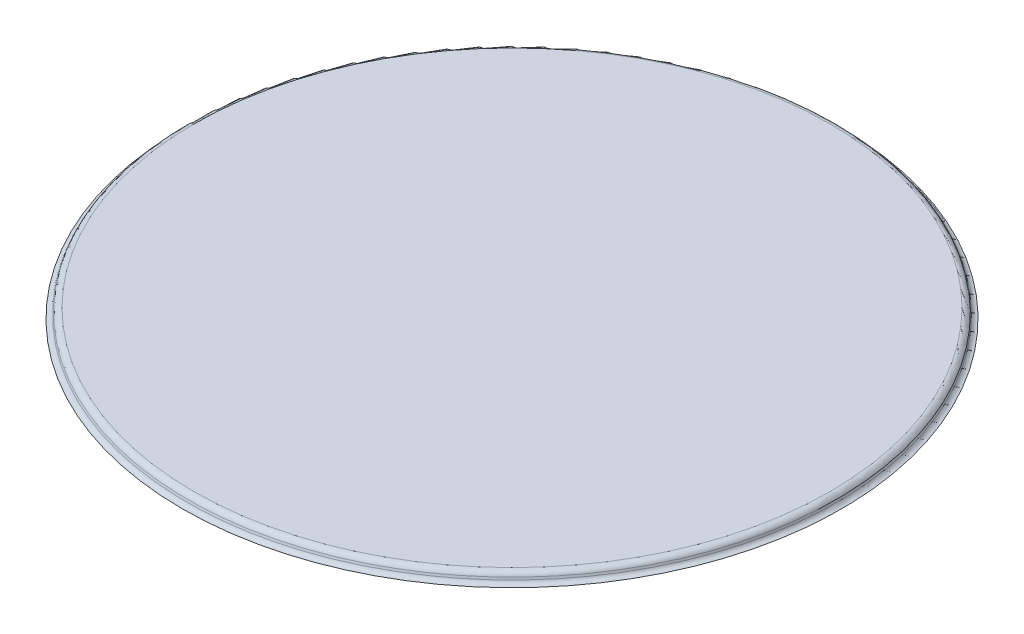
ISO-10303-21;
HEADER;
FILE_DESCRIPTION(('STEP AP214'),'2;1');
FILE_NAME('part.step','',(''),(''),'','','');
FILE_SCHEMA(('AUTOMOTIVE_DESIGN { 1 0 10303 214 1 1 1 1 }'));
ENDSEC;
DATA;
#1=APPLICATION_CONTEXT('core data for automotive mechanical design processes');
#2=APPLICATION_PROTOCOL_DEFINITION('international standard','automotive_design',2000,#1);
#3=PRODUCT_CONTEXT('',#1,'mechanical');
#4=PRODUCT('Part','Part','',(#3));
#5=PRODUCT_RELATED_PRODUCT_CATEGORY('part','',(#4));
#6=PRODUCT_DEFINITION_FORMATION('','',#4);
#7=PRODUCT_DEFINITION_CONTEXT('part definition',#1,'design');
#8=PRODUCT_DEFINITION('design','',#6,#7);
#9=PRODUCT_DEFINITION_SHAPE('','',#8);
#10=(LENGTH_UNIT() NAMED_UNIT(*) SI_UNIT(.MILLI.,.METRE.));
#11=(NAMED_UNIT(*) PLANE_ANGLE_UNIT() SI_UNIT($,.RADIAN.));
#12=(NAMED_UNIT(*) SI_UNIT($,.STERADIAN.) SOLID_ANGLE_UNIT());
#13=UNCERTAINTY_MEASURE_WITH_UNIT(LENGTH_MEASURE(1.E-05),#10,'distance_accuracy_value','');
#14=(GEOMETRIC_REPRESENTATION_CONTEXT(3) GLOBAL_UNCERTAINTY_ASSIGNED_CONTEXT((#13)) GLOBAL_UNIT_ASSIGNED_CONTEXT((#10,
#11,#12)) REPRESENTATION_CONTEXT('',''));
#15=CARTESIAN_POINT('',(0.,0.,0.));
#16=DIRECTION('',(0.,0.,1.));
#17=DIRECTION('',(1.,0.,0.));
#18=AXIS2_PLACEMENT_3D('',#15,#16,#17);
#19=CARTESIAN_POINT('',(0.,10.8,0.));
#20=DIRECTION('',(0.,-1.,0.));
#21=DIRECTION('',(0.,0.,-1.));
#22=AXIS2_PLACEMENT_3D('',#19,#20,#21);
#23=TOROIDAL_SURFACE('',#22,52.5,0.800000000000003);
#24=CARTESIAN_POINT('',(0.,10.,0.));
#25=DIRECTION('',(0.,-1.,0.));
#26=DIRECTION('',(0.,0.,-1.));
#27=AXIS2_PLACEMENT_3D('',#24,#25,#26);
#28=CIRCLE('',#27,52.5);
#29=CARTESIAN_POINT('',(0.,10.,-52.5));
#30=VERTEX_POINT('',#29);
#31=EDGE_CURVE('E50',#30,#30,#28,.F.);
#32=ORIENTED_EDGE('',*,*,#31,.T.);
#33=EDGE_LOOP('',(#32));
#34=FACE_BOUND('',#33,.T.);
#35=CARTESIAN_POINT('',(0.,10.5263838853395,0.));
#36=DIRECTION('',(0.,-1.,0.));
#37=DIRECTION('',(0.,0.,-1.));
#38=AXIS2_PLACEMENT_3D('',#35,#36,#37);
#39=CIRCLE('',#38,51.7482459033713);
#40=CARTESIAN_POINT('',(0.,10.5263838853395,-51.7482459033713));
#41=VERTEX_POINT('',#40);
#42=EDGE_CURVE('E11',#41,#41,#39,.T.);
#43=ORIENTED_EDGE('',*,*,#42,.T.);
#44=EDGE_LOOP('',(#43));
#45=FACE_BOUND('',#44,.T.);
#46=ADVANCED_FACE('F36',(#34,#45),#23,.F.);
#47=CARTESIAN_POINT('',(0.,10.8420201433257,0.));
#48=DIRECTION('',(0.,-1.,0.));
#49=DIRECTION('',(0.,0.,-1.));
#50=AXIS2_PLACEMENT_3D('',#47,#48,#49);
#51=CONICAL_SURFACE('',#50,51.6333637006091,0.349065850398861);
#52=ORIENTED_EDGE('',*,*,#42,.F.);
#53=EDGE_LOOP('',(#52));
#54=FACE_BOUND('',#53,.T.);
#55=CARTESIAN_POINT('',(0.,10.8420201433257,0.));
#56=DIRECTION('',(0.,-1.,0.));
#57=DIRECTION('',(0.,0.,-1.));
#58=AXIS2_PLACEMENT_3D('',#55,#56,#57);
#59=CIRCLE('',#58,51.6333637006091);
#60=CARTESIAN_POINT('',(0.,10.8420201433257,-51.6333637006091));
#61=VERTEX_POINT('',#60);
#62=EDGE_CURVE('E42',#61,#61,#59,.T.);
#63=ORIENTED_EDGE('',*,*,#62,.T.);
#64=EDGE_LOOP('',(#63));
#65=FACE_BOUND('',#64,.T.);
#66=ADVANCED_FACE('F68',(#54,#65),#51,.T.);
#67=CARTESIAN_POINT('',(0.,10.5,0.));
#68=DIRECTION('',(0.,-1.,0.));
#69=DIRECTION('',(0.,0.,-1.));
#70=AXIS2_PLACEMENT_3D('',#67,#68,#69);
#71=TOROIDAL_SURFACE('',#70,50.6936710798232,1.);
#72=ORIENTED_EDGE('',*,*,#62,.F.);
#73=EDGE_LOOP('',(#72));
#74=FACE_BOUND('',#73,.T.);
#75=CARTESIAN_POINT('',(0.,11.5,0.));
#76=DIRECTION('',(0.,-1.,0.));
#77=DIRECTION('',(0.,0.,-1.));
#78=AXIS2_PLACEMENT_3D('',#75,#76,#77);
#79=CIRCLE('',#78,50.6936710798232);
#80=CARTESIAN_POINT('',(0.,11.5,-50.6936710798232));
#81=VERTEX_POINT('',#80);
#82=EDGE_CURVE('E46',#81,#81,#79,.T.);
#83=ORIENTED_EDGE('',*,*,#82,.T.);
#84=EDGE_LOOP('',(#83));
#85=FACE_BOUND('',#84,.T.);
#86=ADVANCED_FACE('F64',(#74,#85),#71,.T.);
#87=CARTESIAN_POINT('',(-50.6936710798232,11.5,0.));
#88=DIRECTION('',(0.,-1.,0.));
#89=DIRECTION('',(0.,0.,-1.));
#90=AXIS2_PLACEMENT_3D('',#87,#88,#89);
#91=PLANE('',#90);
#92=ORIENTED_EDGE('',*,*,#82,.F.);
#93=EDGE_LOOP('',(#92));
#94=FACE_BOUND('',#93,.T.);
#95=ADVANCED_FACE('F59',(#94),#91,.F.);
#96=CARTESIAN_POINT('',(0.,10.,0.));
#97=DIRECTION('',(0.,1.,0.));
#98=DIRECTION('',(0.,0.,1.));
#99=AXIS2_PLACEMENT_3D('',#96,#97,#98);
#100=PLANE('',#99);
#101=ORIENTED_EDGE('',*,*,#31,.F.);
#102=EDGE_LOOP('',(#101));
#103=FACE_BOUND('',#102,.T.);
#104=ADVANCED_FACE('F57',(#103),#100,.F.);
#105=CLOSED_SHELL('',(#46,#66,#86,#95,#104));
#106=MANIFOLD_SOLID_BREP('B2',#105);
#107=ADVANCED_BREP_SHAPE_REPRESENTATION('',(#18,#106),#14);
#108=SHAPE_DEFINITION_REPRESENTATION(#9,#107);
ENDSEC;
END-ISO-10303-21;
